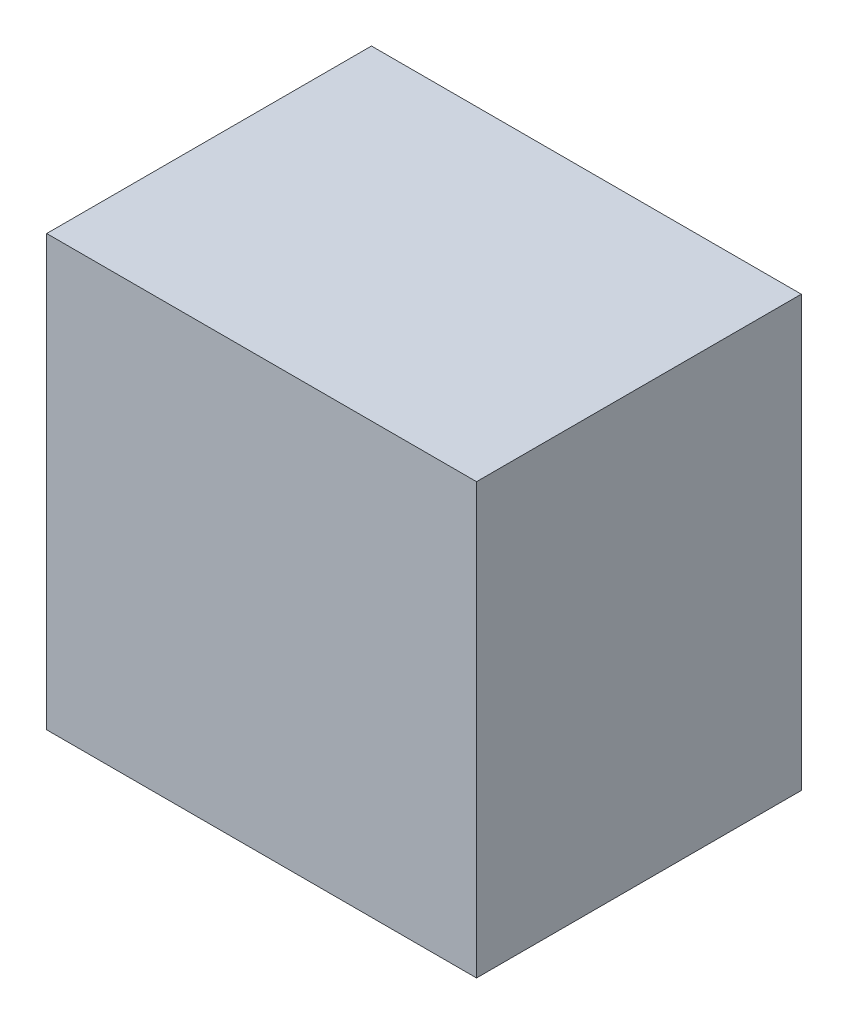
ISO-10303-21;
HEADER;
FILE_DESCRIPTION(('STEP AP214'),'2;1');
FILE_NAME('part.step','',(''),(''),'','','');
FILE_SCHEMA(('AUTOMOTIVE_DESIGN { 1 0 10303 214 1 1 1 1 }'));
ENDSEC;
DATA;
#1=APPLICATION_CONTEXT('core data for automotive mechanical design processes');
#2=APPLICATION_PROTOCOL_DEFINITION('international standard','automotive_design',2000,#1);
#3=PRODUCT_CONTEXT('',#1,'mechanical');
#4=PRODUCT('Part','Part','',(#3));
#5=PRODUCT_RELATED_PRODUCT_CATEGORY('part','',(#4));
#6=PRODUCT_DEFINITION_FORMATION('','',#4);
#7=PRODUCT_DEFINITION_CONTEXT('part definition',#1,'design');
#8=PRODUCT_DEFINITION('design','',#6,#7);
#9=PRODUCT_DEFINITION_SHAPE('','',#8);
#10=(LENGTH_UNIT() NAMED_UNIT(*) SI_UNIT(.MILLI.,.METRE.));
#11=(NAMED_UNIT(*) PLANE_ANGLE_UNIT() SI_UNIT($,.RADIAN.));
#12=(NAMED_UNIT(*) SI_UNIT($,.STERADIAN.) SOLID_ANGLE_UNIT());
#13=UNCERTAINTY_MEASURE_WITH_UNIT(LENGTH_MEASURE(1.E-05),#10,'distance_accuracy_value','');
#14=(GEOMETRIC_REPRESENTATION_CONTEXT(3) GLOBAL_UNCERTAINTY_ASSIGNED_CONTEXT((#13)) GLOBAL_UNIT_ASSIGNED_CONTEXT((#10,
#11,#12)) REPRESENTATION_CONTEXT('',''));
#15=CARTESIAN_POINT('',(0.,0.,0.));
#16=DIRECTION('',(0.,0.,1.));
#17=DIRECTION('',(1.,0.,0.));
#18=AXIS2_PLACEMENT_3D('',#15,#16,#17);
#19=CARTESIAN_POINT('',(90.,90.,68.));
#20=DIRECTION('',(-1.,0.,0.));
#21=DIRECTION('',(0.,-1.,0.));
#22=AXIS2_PLACEMENT_3D('',#19,#20,#21);
#23=PLANE('',#22);
#24=DIRECTION('',(0.,1.,0.));
#25=VECTOR('',#24,1.);
#26=CARTESIAN_POINT('',(90.,90.,-68.));
#27=LINE('',#26,#25);
#28=CARTESIAN_POINT('',(90.,-90.,-68.));
#29=VERTEX_POINT('',#28);
#30=CARTESIAN_POINT('',(90.,90.,-68.));
#31=VERTEX_POINT('',#30);
#32=EDGE_CURVE('E97',#29,#31,#27,.T.);
#33=ORIENTED_EDGE('',*,*,#32,.T.);
#34=DIRECTION('',(0.,0.,-1.));
#35=VECTOR('',#34,1.);
#36=CARTESIAN_POINT('',(90.,90.,68.));
#37=LINE('',#36,#35);
#38=CARTESIAN_POINT('',(90.,90.,68.));
#39=VERTEX_POINT('',#38);
#40=EDGE_CURVE('E11',#39,#31,#37,.T.);
#41=ORIENTED_EDGE('',*,*,#40,.F.);
#42=DIRECTION('',(0.,1.,0.));
#43=VECTOR('',#42,1.);
#44=CARTESIAN_POINT('',(90.,90.,68.));
#45=LINE('',#44,#43);
#46=CARTESIAN_POINT('',(90.,-90.,68.));
#47=VERTEX_POINT('',#46);
#48=EDGE_CURVE('E85',#47,#39,#45,.T.);
#49=ORIENTED_EDGE('',*,*,#48,.F.);
#50=DIRECTION('',(0.,0.,-1.));
#51=VECTOR('',#50,1.);
#52=CARTESIAN_POINT('',(90.,-90.,68.));
#53=LINE('',#52,#51);
#54=EDGE_CURVE('E93',#47,#29,#53,.T.);
#55=ORIENTED_EDGE('',*,*,#54,.T.);
#56=EDGE_LOOP('',(#33,#41,#49,#55));
#57=FACE_BOUND('',#56,.T.);
#58=ADVANCED_FACE('F34',(#57),#23,.F.);
#59=CARTESIAN_POINT('',(-90.,90.,68.));
#60=DIRECTION('',(0.,-1.,0.));
#61=DIRECTION('',(0.,0.,-1.));
#62=AXIS2_PLACEMENT_3D('',#59,#60,#61);
#63=PLANE('',#62);
#64=DIRECTION('',(-1.,0.,0.));
#65=VECTOR('',#64,1.);
#66=CARTESIAN_POINT('',(-90.,90.,-68.));
#67=LINE('',#66,#65);
#68=CARTESIAN_POINT('',(-90.,90.,-68.));
#69=VERTEX_POINT('',#68);
#70=EDGE_CURVE('E89',#31,#69,#67,.T.);
#71=ORIENTED_EDGE('',*,*,#70,.T.);
#72=DIRECTION('',(0.,0.,-1.));
#73=VECTOR('',#72,1.);
#74=CARTESIAN_POINT('',(-90.,90.,68.));
#75=LINE('',#74,#73);
#76=CARTESIAN_POINT('',(-90.,90.,68.));
#77=VERTEX_POINT('',#76);
#78=EDGE_CURVE('E42',#77,#69,#75,.T.);
#79=ORIENTED_EDGE('',*,*,#78,.F.);
#80=DIRECTION('',(-1.,0.,0.));
#81=VECTOR('',#80,1.);
#82=CARTESIAN_POINT('',(-90.,90.,68.));
#83=LINE('',#82,#81);
#84=EDGE_CURVE('E80',#39,#77,#83,.T.);
#85=ORIENTED_EDGE('',*,*,#84,.F.);
#86=ORIENTED_EDGE('',*,*,#40,.T.);
#87=EDGE_LOOP('',(#71,#79,#85,#86));
#88=FACE_BOUND('',#87,.T.);
#89=ADVANCED_FACE('F88',(#88),#63,.F.);
#90=CARTESIAN_POINT('',(-90.,90.,68.));
#91=DIRECTION('',(1.,0.,0.));
#92=DIRECTION('',(0.,1.,0.));
#93=AXIS2_PLACEMENT_3D('',#90,#91,#92);
#94=PLANE('',#93);
#95=DIRECTION('',(0.,-1.,0.));
#96=VECTOR('',#95,1.);
#97=CARTESIAN_POINT('',(-90.,90.,-68.));
#98=LINE('',#97,#96);
#99=CARTESIAN_POINT('',(-89.9999999999999,-90.,-68.));
#100=VERTEX_POINT('',#99);
#101=EDGE_CURVE('E67',#69,#100,#98,.T.);
#102=ORIENTED_EDGE('',*,*,#101,.T.);
#103=DIRECTION('',(0.,0.,-1.));
#104=VECTOR('',#103,1.);
#105=CARTESIAN_POINT('',(-89.9999999999999,-90.,68.));
#106=LINE('',#105,#104);
#107=CARTESIAN_POINT('',(-89.9999999999999,-90.,68.));
#108=VERTEX_POINT('',#107);
#109=EDGE_CURVE('E90',#108,#100,#106,.T.);
#110=ORIENTED_EDGE('',*,*,#109,.F.);
#111=DIRECTION('',(0.,-1.,0.));
#112=VECTOR('',#111,1.);
#113=CARTESIAN_POINT('',(-90.,90.,68.));
#114=LINE('',#113,#112);
#115=EDGE_CURVE('E83',#77,#108,#114,.T.);
#116=ORIENTED_EDGE('',*,*,#115,.F.);
#117=ORIENTED_EDGE('',*,*,#78,.T.);
#118=EDGE_LOOP('',(#102,#110,#116,#117));
#119=FACE_BOUND('',#118,.T.);
#120=ADVANCED_FACE('F91',(#119),#94,.F.);
#121=CARTESIAN_POINT('',(-89.9999999999999,-90.,68.));
#122=DIRECTION('',(0.,1.,0.));
#123=DIRECTION('',(0.,0.,1.));
#124=AXIS2_PLACEMENT_3D('',#121,#122,#123);
#125=PLANE('',#124);
#126=DIRECTION('',(1.,0.,0.));
#127=VECTOR('',#126,1.);
#128=CARTESIAN_POINT('',(-89.9999999999999,-90.,-68.));
#129=LINE('',#128,#127);
#130=EDGE_CURVE('E73',#100,#29,#129,.T.);
#131=ORIENTED_EDGE('',*,*,#130,.T.);
#132=ORIENTED_EDGE('',*,*,#54,.F.);
#133=DIRECTION('',(1.,0.,0.));
#134=VECTOR('',#133,1.);
#135=CARTESIAN_POINT('',(-89.9999999999999,-90.,68.));
#136=LINE('',#135,#134);
#137=EDGE_CURVE('E50',#108,#47,#136,.T.);
#138=ORIENTED_EDGE('',*,*,#137,.F.);
#139=ORIENTED_EDGE('',*,*,#109,.T.);
#140=EDGE_LOOP('',(#131,#132,#138,#139));
#141=FACE_BOUND('',#140,.T.);
#142=ADVANCED_FACE('F104',(#141),#125,.F.);
#143=CARTESIAN_POINT('',(0.,0.,68.));
#144=DIRECTION('',(0.,0.,1.));
#145=DIRECTION('',(1.,0.,0.));
#146=AXIS2_PLACEMENT_3D('',#143,#144,#145);
#147=PLANE('',#146);
#148=ORIENTED_EDGE('',*,*,#48,.T.);
#149=ORIENTED_EDGE('',*,*,#84,.T.);
#150=ORIENTED_EDGE('',*,*,#115,.T.);
#151=ORIENTED_EDGE('',*,*,#137,.T.);
#152=EDGE_LOOP('',(#148,#149,#150,#151));
#153=FACE_BOUND('',#152,.T.);
#154=ADVANCED_FACE('F81',(#153),#147,.T.);
#155=CARTESIAN_POINT('',(0.,0.,-68.));
#156=DIRECTION('',(0.,0.,1.));
#157=DIRECTION('',(1.,0.,0.));
#158=AXIS2_PLACEMENT_3D('',#155,#156,#157);
#159=PLANE('',#158);
#160=ORIENTED_EDGE('',*,*,#32,.F.);
#161=ORIENTED_EDGE('',*,*,#130,.F.);
#162=ORIENTED_EDGE('',*,*,#101,.F.);
#163=ORIENTED_EDGE('',*,*,#70,.F.);
#164=EDGE_LOOP('',(#160,#161,#162,#163));
#165=FACE_BOUND('',#164,.T.);
#166=ADVANCED_FACE('F107',(#165),#159,.F.);
#167=CLOSED_SHELL('',(#58,#89,#120,#142,#154,#166));
#168=MANIFOLD_SOLID_BREP('B2',#167);
#169=ADVANCED_BREP_SHAPE_REPRESENTATION('',(#18,#168),#14);
#170=SHAPE_DEFINITION_REPRESENTATION(#9,#169);
ENDSEC;
END-ISO-10303-21;
